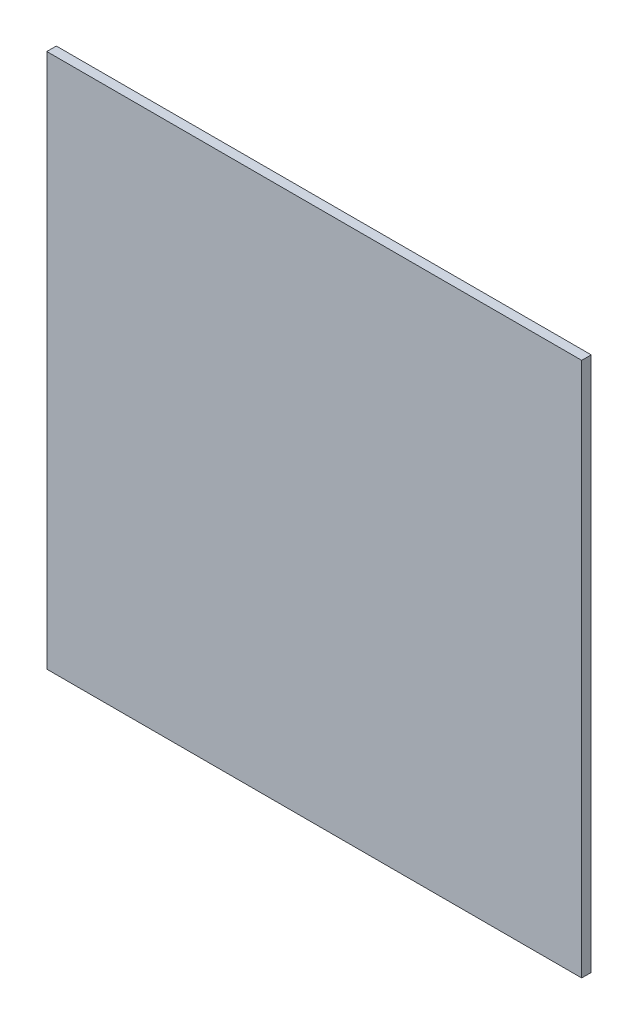
ISO-10303-21;
HEADER;
FILE_DESCRIPTION(('STEP AP214'),'2;1');
FILE_NAME('part.step','',(''),(''),'','','');
FILE_SCHEMA(('AUTOMOTIVE_DESIGN { 1 0 10303 214 1 1 1 1 }'));
ENDSEC;
DATA;
#1=APPLICATION_CONTEXT('core data for automotive mechanical design processes');
#2=APPLICATION_PROTOCOL_DEFINITION('international standard','automotive_design',2000,#1);
#3=PRODUCT_CONTEXT('',#1,'mechanical');
#4=PRODUCT('Part','Part','',(#3));
#5=PRODUCT_RELATED_PRODUCT_CATEGORY('part','',(#4));
#6=PRODUCT_DEFINITION_FORMATION('','',#4);
#7=PRODUCT_DEFINITION_CONTEXT('part definition',#1,'design');
#8=PRODUCT_DEFINITION('design','',#6,#7);
#9=PRODUCT_DEFINITION_SHAPE('','',#8);
#10=(LENGTH_UNIT() NAMED_UNIT(*) SI_UNIT(.MILLI.,.METRE.));
#11=(NAMED_UNIT(*) PLANE_ANGLE_UNIT() SI_UNIT($,.RADIAN.));
#12=(NAMED_UNIT(*) SI_UNIT($,.STERADIAN.) SOLID_ANGLE_UNIT());
#13=UNCERTAINTY_MEASURE_WITH_UNIT(LENGTH_MEASURE(1.E-05),#10,'distance_accuracy_value','');
#14=(GEOMETRIC_REPRESENTATION_CONTEXT(3) GLOBAL_UNCERTAINTY_ASSIGNED_CONTEXT((#13)) GLOBAL_UNIT_ASSIGNED_CONTEXT((#10,
#11,#12)) REPRESENTATION_CONTEXT('',''));
#15=CARTESIAN_POINT('',(0.,0.,0.));
#16=DIRECTION('',(0.,0.,1.));
#17=DIRECTION('',(1.,0.,0.));
#18=AXIS2_PLACEMENT_3D('',#15,#16,#17);
#19=CARTESIAN_POINT('',(225.,-225.,8.));
#20=DIRECTION('',(-1.,0.,0.));
#21=DIRECTION('',(0.,0.,1.));
#22=AXIS2_PLACEMENT_3D('',#19,#20,#21);
#23=PLANE('',#22);
#24=DIRECTION('',(0.,1.,0.));
#25=VECTOR('',#24,1.);
#26=CARTESIAN_POINT('',(225.,-225.,0.));
#27=LINE('',#26,#25);
#28=CARTESIAN_POINT('',(225.,-225.,0.));
#29=VERTEX_POINT('',#28);
#30=CARTESIAN_POINT('',(225.,225.,0.));
#31=VERTEX_POINT('',#30);
#32=EDGE_CURVE('E96',#29,#31,#27,.T.);
#33=ORIENTED_EDGE('',*,*,#32,.T.);
#34=DIRECTION('',(0.,0.,-1.));
#35=VECTOR('',#34,1.);
#36=CARTESIAN_POINT('',(225.,225.,8.));
#37=LINE('',#36,#35);
#38=CARTESIAN_POINT('',(225.,225.,8.));
#39=VERTEX_POINT('',#38);
#40=EDGE_CURVE('E11',#39,#31,#37,.T.);
#41=ORIENTED_EDGE('',*,*,#40,.F.);
#42=DIRECTION('',(0.,1.,0.));
#43=VECTOR('',#42,1.);
#44=CARTESIAN_POINT('',(225.,-225.,8.));
#45=LINE('',#44,#43);
#46=CARTESIAN_POINT('',(225.,-225.,8.));
#47=VERTEX_POINT('',#46);
#48=EDGE_CURVE('E84',#47,#39,#45,.T.);
#49=ORIENTED_EDGE('',*,*,#48,.F.);
#50=DIRECTION('',(0.,0.,-1.));
#51=VECTOR('',#50,1.);
#52=CARTESIAN_POINT('',(225.,-225.,8.));
#53=LINE('',#52,#51);
#54=EDGE_CURVE('E92',#47,#29,#53,.T.);
#55=ORIENTED_EDGE('',*,*,#54,.T.);
#56=EDGE_LOOP('',(#33,#41,#49,#55));
#57=FACE_BOUND('',#56,.T.);
#58=ADVANCED_FACE('F33',(#57),#23,.F.);
#59=CARTESIAN_POINT('',(-225.,225.,8.));
#60=DIRECTION('',(0.,-1.,0.));
#61=DIRECTION('',(0.,0.,-1.));
#62=AXIS2_PLACEMENT_3D('',#59,#60,#61);
#63=PLANE('',#62);
#64=DIRECTION('',(-1.,0.,0.));
#65=VECTOR('',#64,1.);
#66=CARTESIAN_POINT('',(-225.,225.,0.));
#67=LINE('',#66,#65);
#68=CARTESIAN_POINT('',(-225.,225.,0.));
#69=VERTEX_POINT('',#68);
#70=EDGE_CURVE('E88',#31,#69,#67,.T.);
#71=ORIENTED_EDGE('',*,*,#70,.T.);
#72=DIRECTION('',(0.,0.,-1.));
#73=VECTOR('',#72,1.);
#74=CARTESIAN_POINT('',(-225.,225.,8.));
#75=LINE('',#74,#73);
#76=CARTESIAN_POINT('',(-225.,225.,8.));
#77=VERTEX_POINT('',#76);
#78=EDGE_CURVE('E41',#77,#69,#75,.T.);
#79=ORIENTED_EDGE('',*,*,#78,.F.);
#80=DIRECTION('',(-1.,0.,0.));
#81=VECTOR('',#80,1.);
#82=CARTESIAN_POINT('',(-225.,225.,8.));
#83=LINE('',#82,#81);
#84=EDGE_CURVE('E79',#39,#77,#83,.T.);
#85=ORIENTED_EDGE('',*,*,#84,.F.);
#86=ORIENTED_EDGE('',*,*,#40,.T.);
#87=EDGE_LOOP('',(#71,#79,#85,#86));
#88=FACE_BOUND('',#87,.T.);
#89=ADVANCED_FACE('F87',(#88),#63,.F.);
#90=CARTESIAN_POINT('',(-225.,-225.,8.));
#91=DIRECTION('',(1.,0.,0.));
#92=DIRECTION('',(0.,0.,-1.));
#93=AXIS2_PLACEMENT_3D('',#90,#91,#92);
#94=PLANE('',#93);
#95=DIRECTION('',(0.,-1.,0.));
#96=VECTOR('',#95,1.);
#97=CARTESIAN_POINT('',(-225.,-225.,0.));
#98=LINE('',#97,#96);
#99=CARTESIAN_POINT('',(-225.,-225.,0.));
#100=VERTEX_POINT('',#99);
#101=EDGE_CURVE('E66',#69,#100,#98,.T.);
#102=ORIENTED_EDGE('',*,*,#101,.T.);
#103=DIRECTION('',(0.,0.,-1.));
#104=VECTOR('',#103,1.);
#105=CARTESIAN_POINT('',(-225.,-225.,8.));
#106=LINE('',#105,#104);
#107=CARTESIAN_POINT('',(-225.,-225.,8.));
#108=VERTEX_POINT('',#107);
#109=EDGE_CURVE('E89',#108,#100,#106,.T.);
#110=ORIENTED_EDGE('',*,*,#109,.F.);
#111=DIRECTION('',(0.,-1.,0.));
#112=VECTOR('',#111,1.);
#113=CARTESIAN_POINT('',(-225.,-225.,8.));
#114=LINE('',#113,#112);
#115=EDGE_CURVE('E82',#77,#108,#114,.T.);
#116=ORIENTED_EDGE('',*,*,#115,.F.);
#117=ORIENTED_EDGE('',*,*,#78,.T.);
#118=EDGE_LOOP('',(#102,#110,#116,#117));
#119=FACE_BOUND('',#118,.T.);
#120=ADVANCED_FACE('F90',(#119),#94,.F.);
#121=CARTESIAN_POINT('',(-225.,-225.,8.));
#122=DIRECTION('',(0.,1.,0.));
#123=DIRECTION('',(0.,0.,1.));
#124=AXIS2_PLACEMENT_3D('',#121,#122,#123);
#125=PLANE('',#124);
#126=DIRECTION('',(1.,0.,0.));
#127=VECTOR('',#126,1.);
#128=CARTESIAN_POINT('',(-225.,-225.,0.));
#129=LINE('',#128,#127);
#130=EDGE_CURVE('E72',#100,#29,#129,.T.);
#131=ORIENTED_EDGE('',*,*,#130,.T.);
#132=ORIENTED_EDGE('',*,*,#54,.F.);
#133=DIRECTION('',(1.,0.,0.));
#134=VECTOR('',#133,1.);
#135=CARTESIAN_POINT('',(-225.,-225.,8.));
#136=LINE('',#135,#134);
#137=EDGE_CURVE('E49',#108,#47,#136,.T.);
#138=ORIENTED_EDGE('',*,*,#137,.F.);
#139=ORIENTED_EDGE('',*,*,#109,.T.);
#140=EDGE_LOOP('',(#131,#132,#138,#139));
#141=FACE_BOUND('',#140,.T.);
#142=ADVANCED_FACE('F103',(#141),#125,.F.);
#143=CARTESIAN_POINT('',(0.,0.,8.));
#144=DIRECTION('',(0.,0.,-1.));
#145=DIRECTION('',(-1.,0.,0.));
#146=AXIS2_PLACEMENT_3D('',#143,#144,#145);
#147=PLANE('',#146);
#148=ORIENTED_EDGE('',*,*,#48,.T.);
#149=ORIENTED_EDGE('',*,*,#84,.T.);
#150=ORIENTED_EDGE('',*,*,#115,.T.);
#151=ORIENTED_EDGE('',*,*,#137,.T.);
#152=EDGE_LOOP('',(#148,#149,#150,#151));
#153=FACE_BOUND('',#152,.T.);
#154=ADVANCED_FACE('F80',(#153),#147,.F.);
#155=CARTESIAN_POINT('',(0.,0.,0.));
#156=DIRECTION('',(0.,0.,-1.));
#157=DIRECTION('',(-1.,0.,0.));
#158=AXIS2_PLACEMENT_3D('',#155,#156,#157);
#159=PLANE('',#158);
#160=ORIENTED_EDGE('',*,*,#32,.F.);
#161=ORIENTED_EDGE('',*,*,#130,.F.);
#162=ORIENTED_EDGE('',*,*,#101,.F.);
#163=ORIENTED_EDGE('',*,*,#70,.F.);
#164=EDGE_LOOP('',(#160,#161,#162,#163));
#165=FACE_BOUND('',#164,.T.);
#166=ADVANCED_FACE('F106',(#165),#159,.T.);
#167=CLOSED_SHELL('',(#58,#89,#120,#142,#154,#166));
#168=MANIFOLD_SOLID_BREP('B2',#167);
#169=ADVANCED_BREP_SHAPE_REPRESENTATION('',(#18,#168),#14);
#170=SHAPE_DEFINITION_REPRESENTATION(#9,#169);
ENDSEC;
END-ISO-10303-21;
